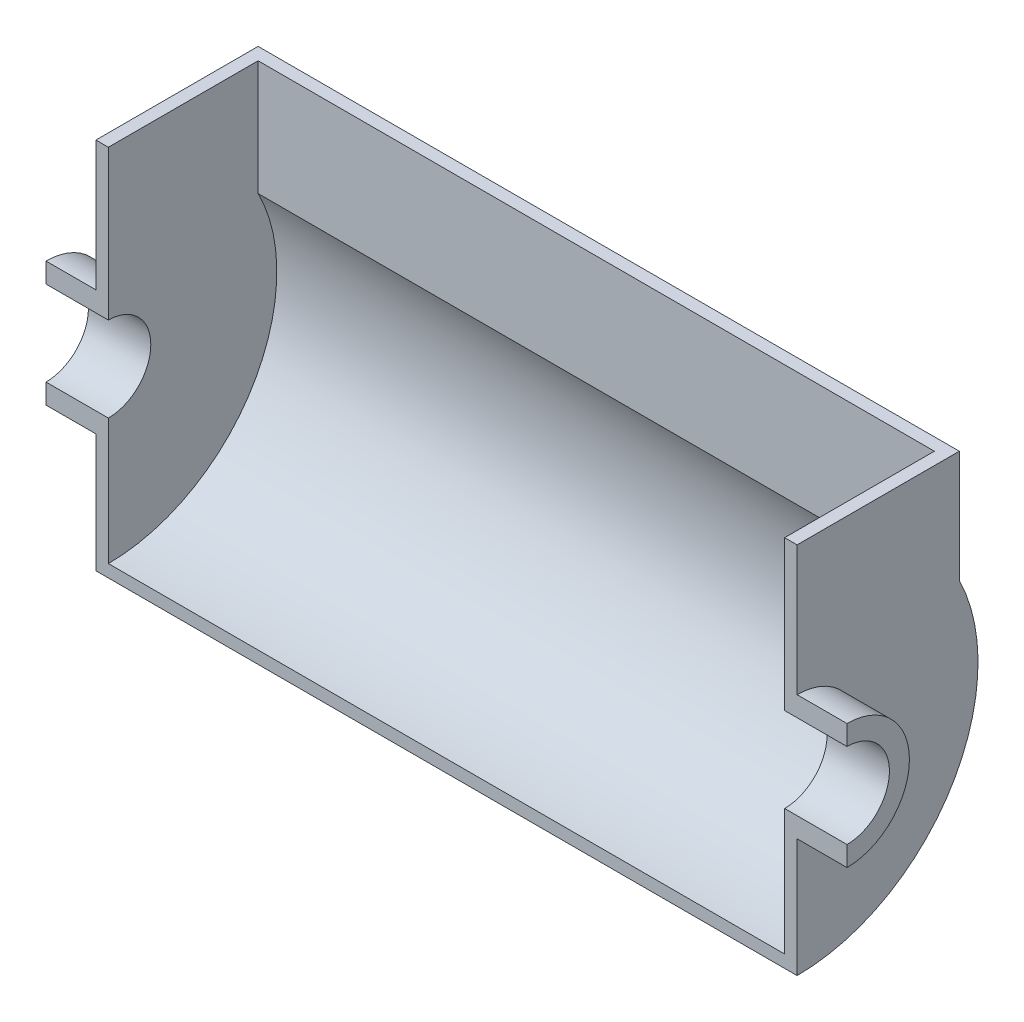
ISO-10303-21;
HEADER;
FILE_DESCRIPTION(('STEP AP214'),'2;1');
FILE_NAME('part.step','',(''),(''),'','','');
FILE_SCHEMA(('AUTOMOTIVE_DESIGN { 1 0 10303 214 1 1 1 1 }'));
ENDSEC;
DATA;
#1=APPLICATION_CONTEXT('core data for automotive mechanical design processes');
#2=APPLICATION_PROTOCOL_DEFINITION('international standard','automotive_design',2000,#1);
#3=PRODUCT_CONTEXT('',#1,'mechanical');
#4=PRODUCT('Part','Part','',(#3));
#5=PRODUCT_RELATED_PRODUCT_CATEGORY('part','',(#4));
#6=PRODUCT_DEFINITION_FORMATION('','',#4);
#7=PRODUCT_DEFINITION_CONTEXT('part definition',#1,'design');
#8=PRODUCT_DEFINITION('design','',#6,#7);
#9=PRODUCT_DEFINITION_SHAPE('','',#8);
#10=(LENGTH_UNIT() NAMED_UNIT(*) SI_UNIT(.MILLI.,.METRE.));
#11=(NAMED_UNIT(*) PLANE_ANGLE_UNIT() SI_UNIT($,.RADIAN.));
#12=(NAMED_UNIT(*) SI_UNIT($,.STERADIAN.) SOLID_ANGLE_UNIT());
#13=UNCERTAINTY_MEASURE_WITH_UNIT(LENGTH_MEASURE(1.E-05),#10,'distance_accuracy_value','');
#14=(GEOMETRIC_REPRESENTATION_CONTEXT(3) GLOBAL_UNCERTAINTY_ASSIGNED_CONTEXT((#13)) GLOBAL_UNIT_ASSIGNED_CONTEXT((#10,
#11,#12)) REPRESENTATION_CONTEXT('',''));
#15=CARTESIAN_POINT('',(0.,0.,0.));
#16=DIRECTION('',(0.,0.,1.));
#17=DIRECTION('',(1.,0.,0.));
#18=AXIS2_PLACEMENT_3D('',#15,#16,#17);
#19=CARTESIAN_POINT('',(-5.,0.,0.));
#20=DIRECTION('',(1.,0.,0.));
#21=DIRECTION('',(0.,0.,-1.));
#22=AXIS2_PLACEMENT_3D('',#19,#20,#21);
#23=PLANE('',#22);
#24=DIRECTION('',(0.,1.,0.));
#25=VECTOR('',#24,1.);
#26=CARTESIAN_POINT('',(-5.,77.,-60.));
#27=LINE('',#26,#25);
#28=CARTESIAN_POINT('',(-5.,30.9232921921324,-60.));
#29=VERTEX_POINT('',#28);
#30=CARTESIAN_POINT('',(-5.,77.,-60.));
#31=VERTEX_POINT('',#30);
#32=EDGE_CURVE('E214',#29,#31,#27,.T.);
#33=ORIENTED_EDGE('',*,*,#32,.F.);
#34=CARTESIAN_POINT('',(-5.,0.,0.));
#35=DIRECTION('',(1.,0.,0.));
#36=DIRECTION('',(0.,0.,1.));
#37=AXIS2_PLACEMENT_3D('',#34,#35,#36);
#38=CIRCLE('',#37,67.5);
#39=CARTESIAN_POINT('',(-5.,-67.5,0.));
#40=VERTEX_POINT('',#39);
#41=EDGE_CURVE('E59',#40,#29,#38,.T.);
#42=ORIENTED_EDGE('',*,*,#41,.F.);
#43=DIRECTION('',(0.,1.,0.));
#44=VECTOR('',#43,1.);
#45=CARTESIAN_POINT('',(-5.,-25.,0.));
#46=LINE('',#45,#44);
#47=CARTESIAN_POINT('',(-5.,-17.,0.));
#48=VERTEX_POINT('',#47);
#49=EDGE_CURVE('E270',#40,#48,#46,.T.);
#50=ORIENTED_EDGE('',*,*,#49,.T.);
#51=CARTESIAN_POINT('',(-5.,0.,0.));
#52=DIRECTION('',(1.,0.,0.));
#53=DIRECTION('',(0.,0.,-1.));
#54=AXIS2_PLACEMENT_3D('',#51,#52,#53);
#55=CIRCLE('',#54,17.);
#56=CARTESIAN_POINT('',(-5.,17.,0.));
#57=VERTEX_POINT('',#56);
#58=EDGE_CURVE('E268',#48,#57,#55,.T.);
#59=ORIENTED_EDGE('',*,*,#58,.T.);
#60=DIRECTION('',(0.,1.,0.));
#61=VECTOR('',#60,1.);
#62=CARTESIAN_POINT('',(-5.,17.,0.));
#63=LINE('',#62,#61);
#64=CARTESIAN_POINT('',(-5.,77.,0.));
#65=VERTEX_POINT('',#64);
#66=EDGE_CURVE('E266',#57,#65,#63,.T.);
#67=ORIENTED_EDGE('',*,*,#66,.T.);
#68=DIRECTION('',(0.,0.,-1.));
#69=VECTOR('',#68,1.);
#70=CARTESIAN_POINT('',(-5.,77.,0.));
#71=LINE('',#70,#69);
#72=EDGE_CURVE('E65',#65,#31,#71,.T.);
#73=ORIENTED_EDGE('',*,*,#72,.T.);
#74=EDGE_LOOP('',(#33,#42,#50,#59,#67,#73));
#75=FACE_BOUND('',#74,.T.);
#76=ADVANCED_FACE('F42',(#75),#23,.F.);
#77=CARTESIAN_POINT('',(-5.,0.,0.));
#78=DIRECTION('',(1.,0.,0.));
#79=DIRECTION('',(0.,0.,-1.));
#80=AXIS2_PLACEMENT_3D('',#77,#78,#79);
#81=CYLINDRICAL_SURFACE('',#80,25.);
#82=CARTESIAN_POINT('',(0.,0.,0.));
#83=DIRECTION('',(1.,0.,0.));
#84=DIRECTION('',(0.,0.,-1.));
#85=AXIS2_PLACEMENT_3D('',#82,#83,#84);
#86=CIRCLE('',#85,25.);
#87=CARTESIAN_POINT('',(0.,-25.,0.));
#88=VERTEX_POINT('',#87);
#89=CARTESIAN_POINT('',(0.,25.,0.));
#90=VERTEX_POINT('',#89);
#91=EDGE_CURVE('E231',#88,#90,#86,.T.);
#92=ORIENTED_EDGE('',*,*,#91,.T.);
#93=DIRECTION('',(1.,0.,0.));
#94=VECTOR('',#93,1.);
#95=CARTESIAN_POINT('',(-5.,25.,0.));
#96=LINE('',#95,#94);
#97=CARTESIAN_POINT('',(20.,25.,0.));
#98=VERTEX_POINT('',#97);
#99=EDGE_CURVE('E46',#90,#98,#96,.T.);
#100=ORIENTED_EDGE('',*,*,#99,.T.);
#101=CARTESIAN_POINT('',(20.,0.,0.));
#102=DIRECTION('',(1.,0.,0.));
#103=DIRECTION('',(0.,0.,-1.));
#104=AXIS2_PLACEMENT_3D('',#101,#102,#103);
#105=CIRCLE('',#104,25.);
#106=CARTESIAN_POINT('',(20.,-25.,0.));
#107=VERTEX_POINT('',#106);
#108=EDGE_CURVE('E248',#107,#98,#105,.T.);
#109=ORIENTED_EDGE('',*,*,#108,.F.);
#110=DIRECTION('',(1.,0.,0.));
#111=VECTOR('',#110,1.);
#112=CARTESIAN_POINT('',(-5.,-25.,0.));
#113=LINE('',#112,#111);
#114=EDGE_CURVE('E11',#88,#107,#113,.T.);
#115=ORIENTED_EDGE('',*,*,#114,.F.);
#116=EDGE_LOOP('',(#92,#100,#109,#115));
#117=FACE_BOUND('',#116,.T.);
#118=ADVANCED_FACE('F44',(#117),#81,.T.);
#119=CARTESIAN_POINT('',(-5.,-25.,0.));
#120=DIRECTION('',(0.,0.,-1.));
#121=DIRECTION('',(-1.,0.,0.));
#122=AXIS2_PLACEMENT_3D('',#119,#120,#121);
#123=PLANE('',#122);
#124=ORIENTED_EDGE('',*,*,#49,.F.);
#125=DIRECTION('',(1.,0.,0.));
#126=VECTOR('',#125,1.);
#127=CARTESIAN_POINT('',(-276.,-67.5,0.));
#128=LINE('',#127,#126);
#129=CARTESIAN_POINT('',(-276.,-67.5,0.));
#130=VERTEX_POINT('',#129);
#131=EDGE_CURVE('E225',#130,#40,#128,.T.);
#132=ORIENTED_EDGE('',*,*,#131,.F.);
#133=DIRECTION('',(0.,1.,0.));
#134=VECTOR('',#133,1.);
#135=CARTESIAN_POINT('',(-276.,0.,0.));
#136=LINE('',#135,#134);
#137=CARTESIAN_POINT('',(-276.,-17.,0.));
#138=VERTEX_POINT('',#137);
#139=EDGE_CURVE('E184',#130,#138,#136,.T.);
#140=ORIENTED_EDGE('',*,*,#139,.T.);
#141=DIRECTION('',(1.,0.,0.));
#142=VECTOR('',#141,1.);
#143=CARTESIAN_POINT('',(-301.,-17.,0.));
#144=LINE('',#143,#142);
#145=CARTESIAN_POINT('',(-301.,-17.,0.));
#146=VERTEX_POINT('',#145);
#147=EDGE_CURVE('E186',#146,#138,#144,.T.);
#148=ORIENTED_EDGE('',*,*,#147,.F.);
#149=DIRECTION('',(0.,1.,0.));
#150=VECTOR('',#149,1.);
#151=CARTESIAN_POINT('',(-301.,0.,0.));
#152=LINE('',#151,#150);
#153=CARTESIAN_POINT('',(-301.,-25.,0.));
#154=VERTEX_POINT('',#153);
#155=EDGE_CURVE('E165',#154,#146,#152,.T.);
#156=ORIENTED_EDGE('',*,*,#155,.F.);
#157=DIRECTION('',(1.,0.,0.));
#158=VECTOR('',#157,1.);
#159=CARTESIAN_POINT('',(-301.,-25.,0.));
#160=LINE('',#159,#158);
#161=CARTESIAN_POINT('',(-281.,-25.,0.));
#162=VERTEX_POINT('',#161);
#163=EDGE_CURVE('E162',#154,#162,#160,.T.);
#164=ORIENTED_EDGE('',*,*,#163,.T.);
#165=DIRECTION('',(0.,1.,0.));
#166=VECTOR('',#165,1.);
#167=CARTESIAN_POINT('',(-281.,0.,0.));
#168=LINE('',#167,#166);
#169=CARTESIAN_POINT('',(-281.,-72.5,0.));
#170=VERTEX_POINT('',#169);
#171=EDGE_CURVE('E200',#170,#162,#168,.T.);
#172=ORIENTED_EDGE('',*,*,#171,.F.);
#173=DIRECTION('',(1.,0.,0.));
#174=VECTOR('',#173,1.);
#175=CARTESIAN_POINT('',(-5.,-72.5,0.));
#176=LINE('',#175,#174);
#177=CARTESIAN_POINT('',(0.,-72.5,0.));
#178=VERTEX_POINT('',#177);
#179=EDGE_CURVE('E230',#170,#178,#176,.T.);
#180=ORIENTED_EDGE('',*,*,#179,.T.);
#181=DIRECTION('',(0.,-1.,0.));
#182=VECTOR('',#181,1.);
#183=CARTESIAN_POINT('',(0.,0.,0.));
#184=LINE('',#183,#182);
#185=EDGE_CURVE('E228',#88,#178,#184,.T.);
#186=ORIENTED_EDGE('',*,*,#185,.F.);
#187=ORIENTED_EDGE('',*,*,#114,.T.);
#188=DIRECTION('',(0.,1.,0.));
#189=VECTOR('',#188,1.);
#190=CARTESIAN_POINT('',(20.,-25.,0.));
#191=LINE('',#190,#189);
#192=CARTESIAN_POINT('',(20.,-17.,0.));
#193=VERTEX_POINT('',#192);
#194=EDGE_CURVE('E263',#107,#193,#191,.T.);
#195=ORIENTED_EDGE('',*,*,#194,.T.);
#196=DIRECTION('',(1.,0.,0.));
#197=VECTOR('',#196,1.);
#198=CARTESIAN_POINT('',(-5.,-17.,0.));
#199=LINE('',#198,#197);
#200=EDGE_CURVE('E51',#48,#193,#199,.T.);
#201=ORIENTED_EDGE('',*,*,#200,.F.);
#202=EDGE_LOOP('',(#124,#132,#140,#148,#156,#164,#172,#180,#186,#187,#195,#201));
#203=FACE_BOUND('',#202,.T.);
#204=ADVANCED_FACE('F295',(#203),#123,.F.);
#205=CARTESIAN_POINT('',(-5.,0.,0.));
#206=DIRECTION('',(1.,0.,0.));
#207=DIRECTION('',(0.,0.,-1.));
#208=AXIS2_PLACEMENT_3D('',#205,#206,#207);
#209=CYLINDRICAL_SURFACE('',#208,17.);
#210=ORIENTED_EDGE('',*,*,#200,.T.);
#211=CARTESIAN_POINT('',(20.,0.,0.));
#212=DIRECTION('',(1.,0.,0.));
#213=DIRECTION('',(0.,0.,-1.));
#214=AXIS2_PLACEMENT_3D('',#211,#212,#213);
#215=CIRCLE('',#214,17.);
#216=CARTESIAN_POINT('',(20.,17.,0.));
#217=VERTEX_POINT('',#216);
#218=EDGE_CURVE('E260',#193,#217,#215,.T.);
#219=ORIENTED_EDGE('',*,*,#218,.T.);
#220=DIRECTION('',(1.,0.,0.));
#221=VECTOR('',#220,1.);
#222=CARTESIAN_POINT('',(-5.,17.,0.));
#223=LINE('',#222,#221);
#224=EDGE_CURVE('E272',#57,#217,#223,.T.);
#225=ORIENTED_EDGE('',*,*,#224,.F.);
#226=ORIENTED_EDGE('',*,*,#58,.F.);
#227=EDGE_LOOP('',(#210,#219,#225,#226));
#228=FACE_BOUND('',#227,.T.);
#229=ADVANCED_FACE('F288',(#228),#209,.F.);
#230=CARTESIAN_POINT('',(-5.,17.,0.));
#231=DIRECTION('',(0.,0.,-1.));
#232=DIRECTION('',(-1.,0.,0.));
#233=AXIS2_PLACEMENT_3D('',#230,#231,#232);
#234=PLANE('',#233);
#235=ORIENTED_EDGE('',*,*,#224,.T.);
#236=DIRECTION('',(0.,1.,0.));
#237=VECTOR('',#236,1.);
#238=CARTESIAN_POINT('',(20.,17.,0.));
#239=LINE('',#238,#237);
#240=EDGE_CURVE('E257',#217,#98,#239,.T.);
#241=ORIENTED_EDGE('',*,*,#240,.T.);
#242=ORIENTED_EDGE('',*,*,#99,.F.);
#243=DIRECTION('',(0.,1.,0.));
#244=VECTOR('',#243,1.);
#245=CARTESIAN_POINT('',(0.,0.,0.));
#246=LINE('',#245,#244);
#247=CARTESIAN_POINT('',(0.,77.,0.));
#248=VERTEX_POINT('',#247);
#249=EDGE_CURVE('E242',#90,#248,#246,.T.);
#250=ORIENTED_EDGE('',*,*,#249,.T.);
#251=DIRECTION('',(1.,0.,0.));
#252=VECTOR('',#251,1.);
#253=CARTESIAN_POINT('',(-5.,77.,0.));
#254=LINE('',#253,#252);
#255=EDGE_CURVE('E245',#65,#248,#254,.T.);
#256=ORIENTED_EDGE('',*,*,#255,.F.);
#257=ORIENTED_EDGE('',*,*,#66,.F.);
#258=EDGE_LOOP('',(#235,#241,#242,#250,#256,#257));
#259=FACE_BOUND('',#258,.T.);
#260=ADVANCED_FACE('F286',(#259),#234,.F.);
#261=CARTESIAN_POINT('',(20.,0.,0.));
#262=DIRECTION('',(1.,0.,0.));
#263=DIRECTION('',(0.,0.,-1.));
#264=AXIS2_PLACEMENT_3D('',#261,#262,#263);
#265=PLANE('',#264);
#266=ORIENTED_EDGE('',*,*,#108,.T.);
#267=ORIENTED_EDGE('',*,*,#240,.F.);
#268=ORIENTED_EDGE('',*,*,#218,.F.);
#269=ORIENTED_EDGE('',*,*,#194,.F.);
#270=EDGE_LOOP('',(#266,#267,#268,#269));
#271=FACE_BOUND('',#270,.T.);
#272=ADVANCED_FACE('F284',(#271),#265,.T.);
#273=CARTESIAN_POINT('',(-5.,77.,0.));
#274=DIRECTION('',(0.,-1.,0.));
#275=DIRECTION('',(0.,0.,-1.));
#276=AXIS2_PLACEMENT_3D('',#273,#274,#275);
#277=PLANE('',#276);
#278=DIRECTION('',(0.,0.,-1.));
#279=VECTOR('',#278,1.);
#280=CARTESIAN_POINT('',(0.,77.,0.));
#281=LINE('',#280,#279);
#282=CARTESIAN_POINT('',(0.,77.,-65.));
#283=VERTEX_POINT('',#282);
#284=EDGE_CURVE('E240',#248,#283,#281,.T.);
#285=ORIENTED_EDGE('',*,*,#284,.T.);
#286=DIRECTION('',(1.,0.,0.));
#287=VECTOR('',#286,1.);
#288=CARTESIAN_POINT('',(-5.,77.,-65.));
#289=LINE('',#288,#287);
#290=CARTESIAN_POINT('',(-281.,77.,-65.));
#291=VERTEX_POINT('',#290);
#292=EDGE_CURVE('E249',#291,#283,#289,.T.);
#293=ORIENTED_EDGE('',*,*,#292,.F.);
#294=DIRECTION('',(0.,0.,-1.));
#295=VECTOR('',#294,1.);
#296=CARTESIAN_POINT('',(-281.,77.,0.));
#297=LINE('',#296,#295);
#298=CARTESIAN_POINT('',(-281.,77.,0.));
#299=VERTEX_POINT('',#298);
#300=EDGE_CURVE('E190',#299,#291,#297,.T.);
#301=ORIENTED_EDGE('',*,*,#300,.F.);
#302=DIRECTION('',(1.,0.,0.));
#303=VECTOR('',#302,1.);
#304=CARTESIAN_POINT('',(-281.,77.,0.));
#305=LINE('',#304,#303);
#306=CARTESIAN_POINT('',(-276.,77.,0.));
#307=VERTEX_POINT('',#306);
#308=EDGE_CURVE('E204',#299,#307,#305,.T.);
#309=ORIENTED_EDGE('',*,*,#308,.T.);
#310=DIRECTION('',(0.,0.,-1.));
#311=VECTOR('',#310,1.);
#312=CARTESIAN_POINT('',(-276.,77.,0.));
#313=LINE('',#312,#311);
#314=CARTESIAN_POINT('',(-276.,77.,-60.));
#315=VERTEX_POINT('',#314);
#316=EDGE_CURVE('E181',#307,#315,#313,.T.);
#317=ORIENTED_EDGE('',*,*,#316,.T.);
#318=DIRECTION('',(1.,0.,0.));
#319=VECTOR('',#318,1.);
#320=CARTESIAN_POINT('',(-276.,77.,-60.));
#321=LINE('',#320,#319);
#322=EDGE_CURVE('E217',#315,#31,#321,.T.);
#323=ORIENTED_EDGE('',*,*,#322,.T.);
#324=ORIENTED_EDGE('',*,*,#72,.F.);
#325=ORIENTED_EDGE('',*,*,#255,.T.);
#326=EDGE_LOOP('',(#285,#293,#301,#309,#317,#323,#324,#325));
#327=FACE_BOUND('',#326,.T.);
#328=ADVANCED_FACE('F293',(#327),#277,.F.);
#329=CARTESIAN_POINT('',(-5.,0.,-65.));
#330=DIRECTION('',(0.,0.,1.));
#331=DIRECTION('',(1.,0.,0.));
#332=AXIS2_PLACEMENT_3D('',#329,#330,#331);
#333=PLANE('',#332);
#334=DIRECTION('',(0.,-1.,0.));
#335=VECTOR('',#334,1.);
#336=CARTESIAN_POINT('',(0.,0.,-65.));
#337=LINE('',#336,#335);
#338=CARTESIAN_POINT('',(0.,32.1130814466628,-65.));
#339=VERTEX_POINT('',#338);
#340=EDGE_CURVE('E237',#283,#339,#337,.T.);
#341=ORIENTED_EDGE('',*,*,#340,.T.);
#342=DIRECTION('',(1.,0.,0.));
#343=VECTOR('',#342,1.);
#344=CARTESIAN_POINT('',(-5.,32.1130814466628,-65.));
#345=LINE('',#344,#343);
#346=CARTESIAN_POINT('',(-281.,32.1130814466628,-65.));
#347=VERTEX_POINT('',#346);
#348=EDGE_CURVE('E252',#347,#339,#345,.T.);
#349=ORIENTED_EDGE('',*,*,#348,.F.);
#350=DIRECTION('',(0.,-1.,0.));
#351=VECTOR('',#350,1.);
#352=CARTESIAN_POINT('',(-281.,0.,-65.));
#353=LINE('',#352,#351);
#354=EDGE_CURVE('E193',#291,#347,#353,.T.);
#355=ORIENTED_EDGE('',*,*,#354,.F.);
#356=ORIENTED_EDGE('',*,*,#292,.T.);
#357=EDGE_LOOP('',(#341,#349,#355,#356));
#358=FACE_BOUND('',#357,.T.);
#359=ADVANCED_FACE('F349',(#358),#333,.F.);
#360=CARTESIAN_POINT('',(-5.,0.,0.));
#361=DIRECTION('',(1.,0.,0.));
#362=DIRECTION('',(0.,0.,-1.));
#363=AXIS2_PLACEMENT_3D('',#360,#361,#362);
#364=CYLINDRICAL_SURFACE('',#363,72.5);
#365=CARTESIAN_POINT('',(0.,0.,0.));
#366=DIRECTION('',(1.,0.,0.));
#367=DIRECTION('',(0.,0.,-1.));
#368=AXIS2_PLACEMENT_3D('',#365,#366,#367);
#369=CIRCLE('',#368,72.5);
#370=EDGE_CURVE('E234',#178,#339,#369,.T.);
#371=ORIENTED_EDGE('',*,*,#370,.F.);
#372=ORIENTED_EDGE('',*,*,#179,.F.);
#373=CARTESIAN_POINT('',(-281.,0.,0.));
#374=DIRECTION('',(-1.,0.,0.));
#375=DIRECTION('',(0.,0.,1.));
#376=AXIS2_PLACEMENT_3D('',#373,#374,#375);
#377=CIRCLE('',#376,72.5);
#378=EDGE_CURVE('E197',#347,#170,#377,.T.);
#379=ORIENTED_EDGE('',*,*,#378,.F.);
#380=ORIENTED_EDGE('',*,*,#348,.T.);
#381=EDGE_LOOP('',(#371,#372,#379,#380));
#382=FACE_BOUND('',#381,.T.);
#383=ADVANCED_FACE('F337',(#382),#364,.T.);
#384=CARTESIAN_POINT('',(0.,0.,0.));
#385=DIRECTION('',(1.,0.,0.));
#386=DIRECTION('',(0.,0.,-1.));
#387=AXIS2_PLACEMENT_3D('',#384,#385,#386);
#388=PLANE('',#387);
#389=ORIENTED_EDGE('',*,*,#185,.T.);
#390=ORIENTED_EDGE('',*,*,#370,.T.);
#391=ORIENTED_EDGE('',*,*,#340,.F.);
#392=ORIENTED_EDGE('',*,*,#284,.F.);
#393=ORIENTED_EDGE('',*,*,#249,.F.);
#394=ORIENTED_EDGE('',*,*,#91,.F.);
#395=EDGE_LOOP('',(#389,#390,#391,#392,#393,#394));
#396=FACE_BOUND('',#395,.T.);
#397=ADVANCED_FACE('F340',(#396),#388,.T.);
#398=CARTESIAN_POINT('',(-276.,0.,0.));
#399=DIRECTION('',(1.,0.,0.));
#400=DIRECTION('',(0.,0.,-1.));
#401=AXIS2_PLACEMENT_3D('',#398,#399,#400);
#402=CYLINDRICAL_SURFACE('',#401,67.5);
#403=ORIENTED_EDGE('',*,*,#41,.T.);
#404=DIRECTION('',(1.,0.,0.));
#405=VECTOR('',#404,1.);
#406=CARTESIAN_POINT('',(-276.,30.9232921921324,-60.));
#407=LINE('',#406,#405);
#408=CARTESIAN_POINT('',(-276.,30.9232921921324,-60.));
#409=VERTEX_POINT('',#408);
#410=EDGE_CURVE('E222',#409,#29,#407,.T.);
#411=ORIENTED_EDGE('',*,*,#410,.F.);
#412=CARTESIAN_POINT('',(-276.,0.,0.));
#413=DIRECTION('',(1.,0.,0.));
#414=DIRECTION('',(0.,0.,1.));
#415=AXIS2_PLACEMENT_3D('',#412,#413,#414);
#416=CIRCLE('',#415,67.5);
#417=EDGE_CURVE('E210',#130,#409,#416,.T.);
#418=ORIENTED_EDGE('',*,*,#417,.F.);
#419=ORIENTED_EDGE('',*,*,#131,.T.);
#420=EDGE_LOOP('',(#403,#411,#418,#419));
#421=FACE_BOUND('',#420,.T.);
#422=ADVANCED_FACE('F313',(#421),#402,.F.);
#423=CARTESIAN_POINT('',(-276.,77.,-60.));
#424=DIRECTION('',(0.,0.,-1.));
#425=DIRECTION('',(-1.,0.,0.));
#426=AXIS2_PLACEMENT_3D('',#423,#424,#425);
#427=PLANE('',#426);
#428=ORIENTED_EDGE('',*,*,#32,.T.);
#429=ORIENTED_EDGE('',*,*,#322,.F.);
#430=DIRECTION('',(0.,1.,0.));
#431=VECTOR('',#430,1.);
#432=CARTESIAN_POINT('',(-276.,77.,-60.));
#433=LINE('',#432,#431);
#434=EDGE_CURVE('E213',#409,#315,#433,.T.);
#435=ORIENTED_EDGE('',*,*,#434,.F.);
#436=ORIENTED_EDGE('',*,*,#410,.T.);
#437=EDGE_LOOP('',(#428,#429,#435,#436));
#438=FACE_BOUND('',#437,.T.);
#439=ADVANCED_FACE('F346',(#438),#427,.F.);
#440=CARTESIAN_POINT('',(-276.,0.,0.));
#441=DIRECTION('',(-1.,0.,0.));
#442=DIRECTION('',(0.,0.,1.));
#443=AXIS2_PLACEMENT_3D('',#440,#441,#442);
#444=PLANE('',#443);
#445=ORIENTED_EDGE('',*,*,#139,.F.);
#446=ORIENTED_EDGE('',*,*,#417,.T.);
#447=ORIENTED_EDGE('',*,*,#434,.T.);
#448=ORIENTED_EDGE('',*,*,#316,.F.);
#449=DIRECTION('',(0.,1.,0.));
#450=VECTOR('',#449,1.);
#451=CARTESIAN_POINT('',(-276.,0.,0.));
#452=LINE('',#451,#450);
#453=CARTESIAN_POINT('',(-276.,17.,0.));
#454=VERTEX_POINT('',#453);
#455=EDGE_CURVE('E194',#454,#307,#452,.T.);
#456=ORIENTED_EDGE('',*,*,#455,.F.);
#457=CARTESIAN_POINT('',(-276.,0.,0.));
#458=DIRECTION('',(-1.,0.,0.));
#459=DIRECTION('',(0.,0.,1.));
#460=AXIS2_PLACEMENT_3D('',#457,#458,#459);
#461=CIRCLE('',#460,17.);
#462=EDGE_CURVE('E175',#454,#138,#461,.T.);
#463=ORIENTED_EDGE('',*,*,#462,.T.);
#464=EDGE_LOOP('',(#445,#446,#447,#448,#456,#463));
#465=FACE_BOUND('',#464,.T.);
#466=ADVANCED_FACE('F318',(#465),#444,.F.);
#467=CARTESIAN_POINT('',(-281.,0.,0.));
#468=DIRECTION('',(0.,0.,-1.));
#469=DIRECTION('',(0.,1.,0.));
#470=AXIS2_PLACEMENT_3D('',#467,#468,#469);
#471=PLANE('',#470);
#472=ORIENTED_EDGE('',*,*,#455,.T.);
#473=ORIENTED_EDGE('',*,*,#308,.F.);
#474=DIRECTION('',(0.,1.,0.));
#475=VECTOR('',#474,1.);
#476=CARTESIAN_POINT('',(-281.,0.,0.));
#477=LINE('',#476,#475);
#478=CARTESIAN_POINT('',(-281.,25.,0.));
#479=VERTEX_POINT('',#478);
#480=EDGE_CURVE('E179',#479,#299,#477,.T.);
#481=ORIENTED_EDGE('',*,*,#480,.F.);
#482=DIRECTION('',(1.,0.,0.));
#483=VECTOR('',#482,1.);
#484=CARTESIAN_POINT('',(-301.,25.,0.));
#485=LINE('',#484,#483);
#486=CARTESIAN_POINT('',(-301.,25.,0.));
#487=VERTEX_POINT('',#486);
#488=EDGE_CURVE('E160',#487,#479,#485,.T.);
#489=ORIENTED_EDGE('',*,*,#488,.F.);
#490=DIRECTION('',(0.,1.,0.));
#491=VECTOR('',#490,1.);
#492=CARTESIAN_POINT('',(-301.,0.,0.));
#493=LINE('',#492,#491);
#494=CARTESIAN_POINT('',(-301.,17.,0.));
#495=VERTEX_POINT('',#494);
#496=EDGE_CURVE('E166',#495,#487,#493,.T.);
#497=ORIENTED_EDGE('',*,*,#496,.F.);
#498=DIRECTION('',(1.,0.,0.));
#499=VECTOR('',#498,1.);
#500=CARTESIAN_POINT('',(-301.,17.,0.));
#501=LINE('',#500,#499);
#502=EDGE_CURVE('E324',#495,#454,#501,.T.);
#503=ORIENTED_EDGE('',*,*,#502,.T.);
#504=EDGE_LOOP('',(#472,#473,#481,#489,#497,#503));
#505=FACE_BOUND('',#504,.T.);
#506=ADVANCED_FACE('F177',(#505),#471,.F.);
#507=CARTESIAN_POINT('',(-281.,0.,0.));
#508=DIRECTION('',(-1.,0.,0.));
#509=DIRECTION('',(0.,0.,1.));
#510=AXIS2_PLACEMENT_3D('',#507,#508,#509);
#511=PLANE('',#510);
#512=ORIENTED_EDGE('',*,*,#300,.T.);
#513=ORIENTED_EDGE('',*,*,#354,.T.);
#514=ORIENTED_EDGE('',*,*,#378,.T.);
#515=ORIENTED_EDGE('',*,*,#171,.T.);
#516=CARTESIAN_POINT('',(-281.,0.,0.));
#517=DIRECTION('',(-1.,0.,0.));
#518=DIRECTION('',(0.,0.,1.));
#519=AXIS2_PLACEMENT_3D('',#516,#517,#518);
#520=CIRCLE('',#519,25.);
#521=EDGE_CURVE('E202',#479,#162,#520,.T.);
#522=ORIENTED_EDGE('',*,*,#521,.F.);
#523=ORIENTED_EDGE('',*,*,#480,.T.);
#524=EDGE_LOOP('',(#512,#513,#514,#515,#522,#523));
#525=FACE_BOUND('',#524,.T.);
#526=ADVANCED_FACE('F333',(#525),#511,.T.);
#527=CARTESIAN_POINT('',(-301.,0.,0.));
#528=DIRECTION('',(1.,0.,0.));
#529=DIRECTION('',(0.,0.,-1.));
#530=AXIS2_PLACEMENT_3D('',#527,#528,#529);
#531=CYLINDRICAL_SURFACE('',#530,25.);
#532=ORIENTED_EDGE('',*,*,#521,.T.);
#533=ORIENTED_EDGE('',*,*,#163,.F.);
#534=CARTESIAN_POINT('',(-301.,0.,0.));
#535=DIRECTION('',(-1.,0.,0.));
#536=DIRECTION('',(0.,0.,1.));
#537=AXIS2_PLACEMENT_3D('',#534,#535,#536);
#538=CIRCLE('',#537,25.);
#539=EDGE_CURVE('E155',#487,#154,#538,.T.);
#540=ORIENTED_EDGE('',*,*,#539,.F.);
#541=ORIENTED_EDGE('',*,*,#488,.T.);
#542=EDGE_LOOP('',(#532,#533,#540,#541));
#543=FACE_BOUND('',#542,.T.);
#544=ADVANCED_FACE('F158',(#543),#531,.T.);
#545=CARTESIAN_POINT('',(-301.,0.,0.));
#546=DIRECTION('',(1.,0.,0.));
#547=DIRECTION('',(0.,0.,-1.));
#548=AXIS2_PLACEMENT_3D('',#545,#546,#547);
#549=CYLINDRICAL_SURFACE('',#548,17.);
#550=ORIENTED_EDGE('',*,*,#462,.F.);
#551=ORIENTED_EDGE('',*,*,#502,.F.);
#552=CARTESIAN_POINT('',(-301.,0.,0.));
#553=DIRECTION('',(-1.,0.,0.));
#554=DIRECTION('',(0.,0.,1.));
#555=AXIS2_PLACEMENT_3D('',#552,#553,#554);
#556=CIRCLE('',#555,17.);
#557=EDGE_CURVE('E172',#495,#146,#556,.T.);
#558=ORIENTED_EDGE('',*,*,#557,.T.);
#559=ORIENTED_EDGE('',*,*,#147,.T.);
#560=EDGE_LOOP('',(#550,#551,#558,#559));
#561=FACE_BOUND('',#560,.T.);
#562=ADVANCED_FACE('F323',(#561),#549,.F.);
#563=CARTESIAN_POINT('',(-301.,0.,0.));
#564=DIRECTION('',(-1.,0.,0.));
#565=DIRECTION('',(0.,0.,1.));
#566=AXIS2_PLACEMENT_3D('',#563,#564,#565);
#567=PLANE('',#566);
#568=ORIENTED_EDGE('',*,*,#496,.T.);
#569=ORIENTED_EDGE('',*,*,#539,.T.);
#570=ORIENTED_EDGE('',*,*,#155,.T.);
#571=ORIENTED_EDGE('',*,*,#557,.F.);
#572=EDGE_LOOP('',(#568,#569,#570,#571));
#573=FACE_BOUND('',#572,.T.);
#574=ADVANCED_FACE('F170',(#573),#567,.T.);
#575=CLOSED_SHELL('',(#76,#118,#204,#229,#260,#272,#328,#359,#383,#397,#422,#439,#466,#506,#526,
#544,#562,#574));
#576=MANIFOLD_SOLID_BREP('B2',#575);
#577=ADVANCED_BREP_SHAPE_REPRESENTATION('',(#18,#576),#14);
#578=SHAPE_DEFINITION_REPRESENTATION(#9,#577);
ENDSEC;
END-ISO-10303-21;
